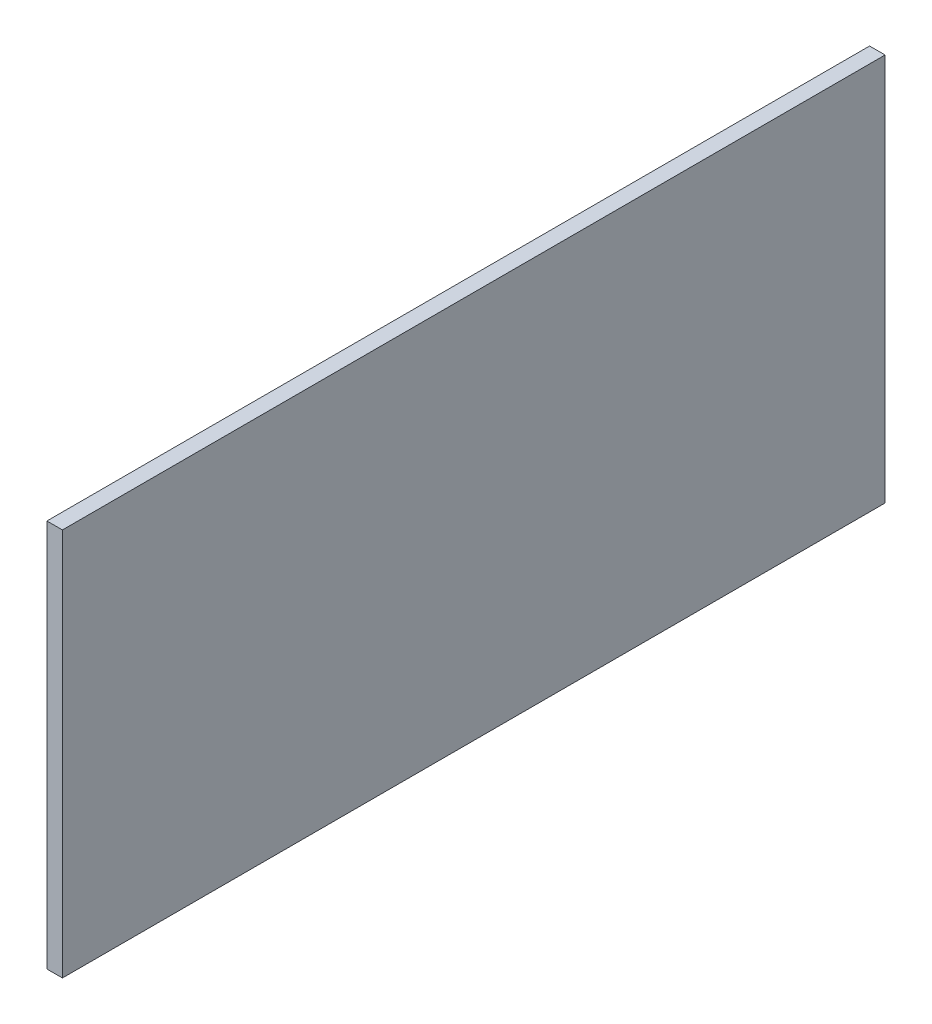
ISO-10303-21;
HEADER;
FILE_DESCRIPTION(('STEP AP214'),'2;1');
FILE_NAME('part.step','',(''),(''),'','','');
FILE_SCHEMA(('AUTOMOTIVE_DESIGN { 1 0 10303 214 1 1 1 1 }'));
ENDSEC;
DATA;
#1=APPLICATION_CONTEXT('core data for automotive mechanical design processes');
#2=APPLICATION_PROTOCOL_DEFINITION('international standard','automotive_design',2000,#1);
#3=PRODUCT_CONTEXT('',#1,'mechanical');
#4=PRODUCT('Part','Part','',(#3));
#5=PRODUCT_RELATED_PRODUCT_CATEGORY('part','',(#4));
#6=PRODUCT_DEFINITION_FORMATION('','',#4);
#7=PRODUCT_DEFINITION_CONTEXT('part definition',#1,'design');
#8=PRODUCT_DEFINITION('design','',#6,#7);
#9=PRODUCT_DEFINITION_SHAPE('','',#8);
#10=(LENGTH_UNIT() NAMED_UNIT(*) SI_UNIT(.MILLI.,.METRE.));
#11=(NAMED_UNIT(*) PLANE_ANGLE_UNIT() SI_UNIT($,.RADIAN.));
#12=(NAMED_UNIT(*) SI_UNIT($,.STERADIAN.) SOLID_ANGLE_UNIT());
#13=UNCERTAINTY_MEASURE_WITH_UNIT(LENGTH_MEASURE(1.E-05),#10,'distance_accuracy_value','');
#14=(GEOMETRIC_REPRESENTATION_CONTEXT(3) GLOBAL_UNCERTAINTY_ASSIGNED_CONTEXT((#13)) GLOBAL_UNIT_ASSIGNED_CONTEXT((#10,
#11,#12)) REPRESENTATION_CONTEXT('',''));
#15=CARTESIAN_POINT('',(0.,0.,0.));
#16=DIRECTION('',(0.,0.,1.));
#17=DIRECTION('',(1.,0.,0.));
#18=AXIS2_PLACEMENT_3D('',#15,#16,#17);
#19=CARTESIAN_POINT('',(3.,37.5,-79.505));
#20=DIRECTION('',(0.,0.,1.));
#21=DIRECTION('',(1.,0.,0.));
#22=AXIS2_PLACEMENT_3D('',#19,#20,#21);
#23=PLANE('',#22);
#24=DIRECTION('',(0.,1.,0.));
#25=VECTOR('',#24,1.);
#26=CARTESIAN_POINT('',(0.,37.5,-79.505));
#27=LINE('',#26,#25);
#28=CARTESIAN_POINT('',(0.,-37.5,-79.505));
#29=VERTEX_POINT('',#28);
#30=CARTESIAN_POINT('',(0.,37.5,-79.505));
#31=VERTEX_POINT('',#30);
#32=EDGE_CURVE('E102',#29,#31,#27,.T.);
#33=ORIENTED_EDGE('',*,*,#32,.T.);
#34=DIRECTION('',(-1.,0.,0.));
#35=VECTOR('',#34,1.);
#36=CARTESIAN_POINT('',(3.,37.5,-79.505));
#37=LINE('',#36,#35);
#38=CARTESIAN_POINT('',(3.,37.5,-79.505));
#39=VERTEX_POINT('',#38);
#40=EDGE_CURVE('E11',#39,#31,#37,.T.);
#41=ORIENTED_EDGE('',*,*,#40,.F.);
#42=DIRECTION('',(0.,1.,0.));
#43=VECTOR('',#42,1.);
#44=CARTESIAN_POINT('',(3.,37.5,-79.505));
#45=LINE('',#44,#43);
#46=CARTESIAN_POINT('',(3.,-37.5,-79.505));
#47=VERTEX_POINT('',#46);
#48=EDGE_CURVE('E90',#47,#39,#45,.T.);
#49=ORIENTED_EDGE('',*,*,#48,.F.);
#50=DIRECTION('',(-1.,0.,0.));
#51=VECTOR('',#50,1.);
#52=CARTESIAN_POINT('',(3.,-37.5,-79.505));
#53=LINE('',#52,#51);
#54=EDGE_CURVE('E98',#47,#29,#53,.T.);
#55=ORIENTED_EDGE('',*,*,#54,.T.);
#56=EDGE_LOOP('',(#33,#41,#49,#55));
#57=FACE_BOUND('',#56,.T.);
#58=ADVANCED_FACE('F39',(#57),#23,.F.);
#59=CARTESIAN_POINT('',(3.,37.5,79.505));
#60=DIRECTION('',(0.,-1.,0.));
#61=DIRECTION('',(0.,0.,-1.));
#62=AXIS2_PLACEMENT_3D('',#59,#60,#61);
#63=PLANE('',#62);
#64=DIRECTION('',(0.,0.,1.));
#65=VECTOR('',#64,1.);
#66=CARTESIAN_POINT('',(0.,37.5,79.505));
#67=LINE('',#66,#65);
#68=CARTESIAN_POINT('',(0.,37.5,79.505));
#69=VERTEX_POINT('',#68);
#70=EDGE_CURVE('E94',#31,#69,#67,.T.);
#71=ORIENTED_EDGE('',*,*,#70,.T.);
#72=DIRECTION('',(-1.,0.,0.));
#73=VECTOR('',#72,1.);
#74=CARTESIAN_POINT('',(3.,37.5,79.505));
#75=LINE('',#74,#73);
#76=CARTESIAN_POINT('',(3.,37.5,79.505));
#77=VERTEX_POINT('',#76);
#78=EDGE_CURVE('E47',#77,#69,#75,.T.);
#79=ORIENTED_EDGE('',*,*,#78,.F.);
#80=DIRECTION('',(0.,0.,1.));
#81=VECTOR('',#80,1.);
#82=CARTESIAN_POINT('',(3.,37.5,79.505));
#83=LINE('',#82,#81);
#84=EDGE_CURVE('E85',#39,#77,#83,.T.);
#85=ORIENTED_EDGE('',*,*,#84,.F.);
#86=ORIENTED_EDGE('',*,*,#40,.T.);
#87=EDGE_LOOP('',(#71,#79,#85,#86));
#88=FACE_BOUND('',#87,.T.);
#89=ADVANCED_FACE('F93',(#88),#63,.F.);
#90=CARTESIAN_POINT('',(3.,37.5,79.505));
#91=DIRECTION('',(0.,0.,-1.));
#92=DIRECTION('',(-1.,0.,0.));
#93=AXIS2_PLACEMENT_3D('',#90,#91,#92);
#94=PLANE('',#93);
#95=DIRECTION('',(0.,-1.,0.));
#96=VECTOR('',#95,1.);
#97=CARTESIAN_POINT('',(0.,37.5,79.505));
#98=LINE('',#97,#96);
#99=CARTESIAN_POINT('',(0.,-37.5,79.505));
#100=VERTEX_POINT('',#99);
#101=EDGE_CURVE('E72',#69,#100,#98,.T.);
#102=ORIENTED_EDGE('',*,*,#101,.T.);
#103=DIRECTION('',(-1.,0.,0.));
#104=VECTOR('',#103,1.);
#105=CARTESIAN_POINT('',(3.,-37.5,79.505));
#106=LINE('',#105,#104);
#107=CARTESIAN_POINT('',(3.,-37.5,79.505));
#108=VERTEX_POINT('',#107);
#109=EDGE_CURVE('E95',#108,#100,#106,.T.);
#110=ORIENTED_EDGE('',*,*,#109,.F.);
#111=DIRECTION('',(0.,-1.,0.));
#112=VECTOR('',#111,1.);
#113=CARTESIAN_POINT('',(3.,37.5,79.505));
#114=LINE('',#113,#112);
#115=EDGE_CURVE('E88',#77,#108,#114,.T.);
#116=ORIENTED_EDGE('',*,*,#115,.F.);
#117=ORIENTED_EDGE('',*,*,#78,.T.);
#118=EDGE_LOOP('',(#102,#110,#116,#117));
#119=FACE_BOUND('',#118,.T.);
#120=ADVANCED_FACE('F96',(#119),#94,.F.);
#121=CARTESIAN_POINT('',(3.,-37.5,79.505));
#122=DIRECTION('',(0.,1.,0.));
#123=DIRECTION('',(0.,0.,1.));
#124=AXIS2_PLACEMENT_3D('',#121,#122,#123);
#125=PLANE('',#124);
#126=DIRECTION('',(0.,0.,-1.));
#127=VECTOR('',#126,1.);
#128=CARTESIAN_POINT('',(0.,-37.5,79.505));
#129=LINE('',#128,#127);
#130=EDGE_CURVE('E78',#100,#29,#129,.T.);
#131=ORIENTED_EDGE('',*,*,#130,.T.);
#132=ORIENTED_EDGE('',*,*,#54,.F.);
#133=DIRECTION('',(0.,0.,-1.));
#134=VECTOR('',#133,1.);
#135=CARTESIAN_POINT('',(3.,-37.5,79.505));
#136=LINE('',#135,#134);
#137=EDGE_CURVE('E55',#108,#47,#136,.T.);
#138=ORIENTED_EDGE('',*,*,#137,.F.);
#139=ORIENTED_EDGE('',*,*,#109,.T.);
#140=EDGE_LOOP('',(#131,#132,#138,#139));
#141=FACE_BOUND('',#140,.T.);
#142=ADVANCED_FACE('F109',(#141),#125,.F.);
#143=CARTESIAN_POINT('',(3.,0.,0.));
#144=DIRECTION('',(1.,0.,0.));
#145=DIRECTION('',(0.,0.,-1.));
#146=AXIS2_PLACEMENT_3D('',#143,#144,#145);
#147=PLANE('',#146);
#148=ORIENTED_EDGE('',*,*,#48,.T.);
#149=ORIENTED_EDGE('',*,*,#84,.T.);
#150=ORIENTED_EDGE('',*,*,#115,.T.);
#151=ORIENTED_EDGE('',*,*,#137,.T.);
#152=EDGE_LOOP('',(#148,#149,#150,#151));
#153=FACE_BOUND('',#152,.T.);
#154=ADVANCED_FACE('F86',(#153),#147,.T.);
#155=CARTESIAN_POINT('',(0.,0.,0.));
#156=DIRECTION('',(1.,0.,0.));
#157=DIRECTION('',(0.,0.,-1.));
#158=AXIS2_PLACEMENT_3D('',#155,#156,#157);
#159=PLANE('',#158);
#160=ORIENTED_EDGE('',*,*,#32,.F.);
#161=ORIENTED_EDGE('',*,*,#130,.F.);
#162=ORIENTED_EDGE('',*,*,#101,.F.);
#163=ORIENTED_EDGE('',*,*,#70,.F.);
#164=EDGE_LOOP('',(#160,#161,#162,#163));
#165=FACE_BOUND('',#164,.T.);
#166=ADVANCED_FACE('F112',(#165),#159,.F.);
#167=CLOSED_SHELL('',(#58,#89,#120,#142,#154,#166));
#168=MANIFOLD_SOLID_BREP('B2',#167);
#169=ADVANCED_BREP_SHAPE_REPRESENTATION('',(#18,#168),#14);
#170=SHAPE_DEFINITION_REPRESENTATION(#9,#169);
ENDSEC;
END-ISO-10303-21;
